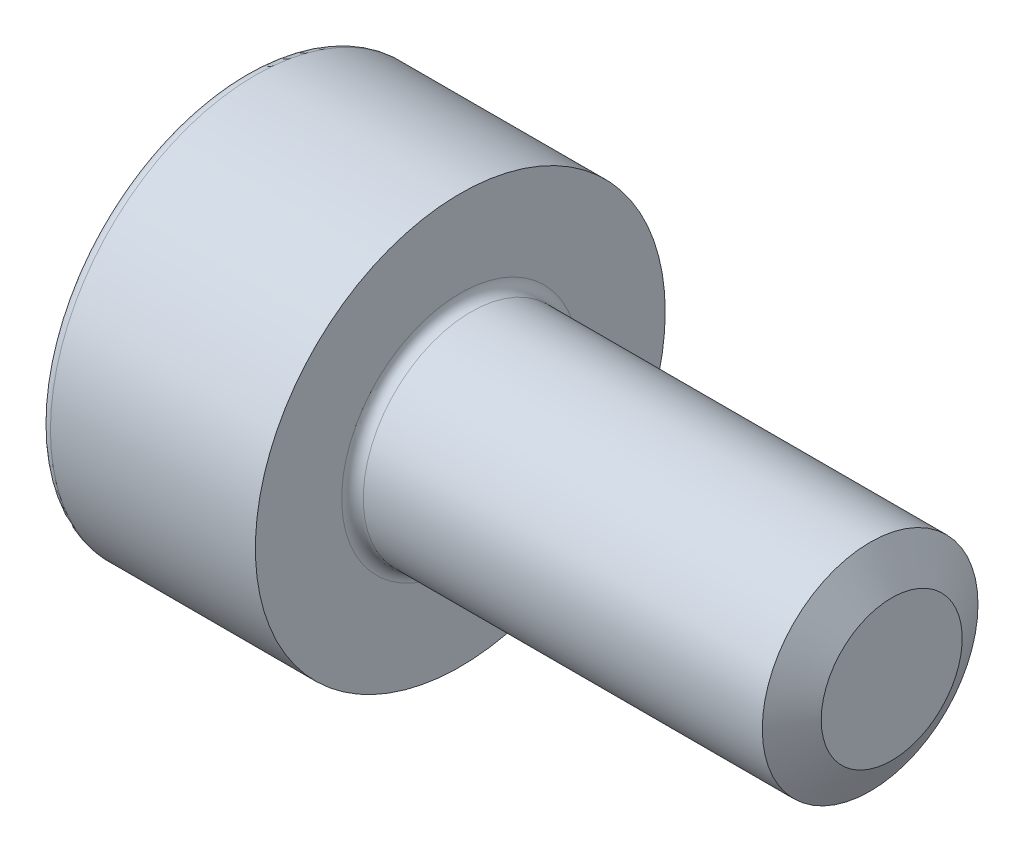
ISO-10303-21;
HEADER;
FILE_DESCRIPTION(('STEP AP214'),'2;1');
FILE_NAME('part.step','',(''),(''),'','','');
FILE_SCHEMA(('AUTOMOTIVE_DESIGN { 1 0 10303 214 1 1 1 1 }'));
ENDSEC;
DATA;
#1=APPLICATION_CONTEXT('core data for automotive mechanical design processes');
#2=APPLICATION_PROTOCOL_DEFINITION('international standard','automotive_design',2000,#1);
#3=PRODUCT_CONTEXT('',#1,'mechanical');
#4=PRODUCT('Part','Part','',(#3));
#5=PRODUCT_RELATED_PRODUCT_CATEGORY('part','',(#4));
#6=PRODUCT_DEFINITION_FORMATION('','',#4);
#7=PRODUCT_DEFINITION_CONTEXT('part definition',#1,'design');
#8=PRODUCT_DEFINITION('design','',#6,#7);
#9=PRODUCT_DEFINITION_SHAPE('','',#8);
#10=(LENGTH_UNIT() NAMED_UNIT(*) SI_UNIT(.MILLI.,.METRE.));
#11=(NAMED_UNIT(*) PLANE_ANGLE_UNIT() SI_UNIT($,.RADIAN.));
#12=(NAMED_UNIT(*) SI_UNIT($,.STERADIAN.) SOLID_ANGLE_UNIT());
#13=UNCERTAINTY_MEASURE_WITH_UNIT(LENGTH_MEASURE(1.E-05),#10,'distance_accuracy_value','');
#14=(GEOMETRIC_REPRESENTATION_CONTEXT(3) GLOBAL_UNCERTAINTY_ASSIGNED_CONTEXT((#13)) GLOBAL_UNIT_ASSIGNED_CONTEXT((#10,
#11,#12)) REPRESENTATION_CONTEXT('',''));
#15=CARTESIAN_POINT('',(0.,0.,0.));
#16=DIRECTION('',(0.,0.,1.));
#17=DIRECTION('',(1.,0.,0.));
#18=AXIS2_PLACEMENT_3D('',#15,#16,#17);
#19=CARTESIAN_POINT('',(0.,0.,0.));
#20=DIRECTION('',(1.,0.,0.));
#21=DIRECTION('',(0.,0.,-1.));
#22=AXIS2_PLACEMENT_3D('',#19,#20,#21);
#23=CYLINDRICAL_SURFACE('',#22,1.);
#24=CARTESIAN_POINT('',(2.1,0.,0.));
#25=DIRECTION('',(1.,0.,0.));
#26=DIRECTION('',(0.,0.,-1.));
#27=AXIS2_PLACEMENT_3D('',#24,#25,#26);
#28=CIRCLE('',#27,1.);
#29=CARTESIAN_POINT('',(2.1,0.,-1.));
#30=VERTEX_POINT('',#29);
#31=EDGE_CURVE('E144',#30,#30,#28,.T.);
#32=ORIENTED_EDGE('',*,*,#31,.T.);
#33=EDGE_LOOP('',(#32));
#34=FACE_BOUND('',#33,.T.);
#35=CARTESIAN_POINT('',(5.8,0.,0.));
#36=DIRECTION('',(-1.,0.,0.));
#37=DIRECTION('',(0.,0.,1.));
#38=AXIS2_PLACEMENT_3D('',#35,#36,#37);
#39=CIRCLE('',#38,1.);
#40=CARTESIAN_POINT('',(5.8,0.,1.));
#41=VERTEX_POINT('',#40);
#42=EDGE_CURVE('E314',#41,#41,#39,.T.);
#43=ORIENTED_EDGE('',*,*,#42,.T.);
#44=EDGE_LOOP('',(#43));
#45=FACE_BOUND('',#44,.T.);
#46=ADVANCED_FACE('F41',(#34,#45),#23,.T.);
#47=CARTESIAN_POINT('',(0.,0.,0.));
#48=DIRECTION('',(-1.,0.,0.));
#49=DIRECTION('',(0.,0.,1.));
#50=AXIS2_PLACEMENT_3D('',#47,#48,#49);
#51=PLANE('',#50);
#52=CARTESIAN_POINT('',(0.,0.,0.));
#53=DIRECTION('',(-1.,0.,0.));
#54=DIRECTION('',(0.,0.,1.));
#55=AXIS2_PLACEMENT_3D('',#52,#53,#54);
#56=CIRCLE('',#55,1.8);
#57=CARTESIAN_POINT('',(0.,0.,1.8));
#58=VERTEX_POINT('',#57);
#59=EDGE_CURVE('E11',#58,#58,#56,.T.);
#60=ORIENTED_EDGE('',*,*,#59,.T.);
#61=EDGE_LOOP('',(#60));
#62=FACE_BOUND('',#61,.T.);
#63=DIRECTION('',(0.,0.5,0.866025403784439));
#64=VECTOR('',#63,1.);
#65=CARTESIAN_POINT('',(0.,-0.865,0.));
#66=LINE('',#65,#64);
#67=CARTESIAN_POINT('',(0.,-0.865,0.));
#68=VERTEX_POINT('',#67);
#69=CARTESIAN_POINT('',(0.,-0.432500000000001,0.749111974273539));
#70=VERTEX_POINT('',#69);
#71=EDGE_CURVE('E56',#68,#70,#66,.T.);
#72=ORIENTED_EDGE('',*,*,#71,.F.);
#73=DIRECTION('',(0.,-0.5,0.866025403784439));
#74=VECTOR('',#73,1.);
#75=CARTESIAN_POINT('',(0.,-0.432500000000001,-0.74911197427354));
#76=LINE('',#75,#74);
#77=CARTESIAN_POINT('',(0.,-0.432500000000001,-0.74911197427354));
#78=VERTEX_POINT('',#77);
#79=EDGE_CURVE('E140',#78,#68,#76,.T.);
#80=ORIENTED_EDGE('',*,*,#79,.F.);
#81=DIRECTION('',(0.,-1.,0.));
#82=VECTOR('',#81,1.);
#83=CARTESIAN_POINT('',(0.,0.4325,-0.74911197427354));
#84=LINE('',#83,#82);
#85=CARTESIAN_POINT('',(0.,0.4325,-0.74911197427354));
#86=VERTEX_POINT('',#85);
#87=EDGE_CURVE('E138',#86,#78,#84,.T.);
#88=ORIENTED_EDGE('',*,*,#87,.F.);
#89=DIRECTION('',(0.,-0.499999999999999,-0.866025403784439));
#90=VECTOR('',#89,1.);
#91=CARTESIAN_POINT('',(0.,0.864999999999999,0.));
#92=LINE('',#91,#90);
#93=CARTESIAN_POINT('',(0.,0.864999999999999,0.));
#94=VERTEX_POINT('',#93);
#95=EDGE_CURVE('E104',#94,#86,#92,.T.);
#96=ORIENTED_EDGE('',*,*,#95,.F.);
#97=DIRECTION('',(0.,0.5,-0.866025403784439));
#98=VECTOR('',#97,1.);
#99=CARTESIAN_POINT('',(0.,0.432499999999999,0.749111974273539));
#100=LINE('',#99,#98);
#101=CARTESIAN_POINT('',(0.,0.432499999999999,0.749111974273539));
#102=VERTEX_POINT('',#101);
#103=EDGE_CURVE('E134',#102,#94,#100,.T.);
#104=ORIENTED_EDGE('',*,*,#103,.F.);
#105=DIRECTION('',(0.,1.,0.));
#106=VECTOR('',#105,1.);
#107=CARTESIAN_POINT('',(0.,-0.432500000000001,0.749111974273539));
#108=LINE('',#107,#106);
#109=EDGE_CURVE('E130',#70,#102,#108,.T.);
#110=ORIENTED_EDGE('',*,*,#109,.F.);
#111=EDGE_LOOP('',(#72,#80,#88,#96,#104,#110));
#112=FACE_BOUND('',#111,.T.);
#113=ADVANCED_FACE('F178',(#62,#112),#51,.T.);
#114=CARTESIAN_POINT('',(0.,0.,0.));
#115=DIRECTION('',(1.,0.,0.));
#116=DIRECTION('',(0.,0.,-1.));
#117=AXIS2_PLACEMENT_3D('',#114,#115,#116);
#118=CYLINDRICAL_SURFACE('',#117,1.9);
#119=CARTESIAN_POINT('',(0.1,0.,0.));
#120=DIRECTION('',(-1.,0.,0.));
#121=DIRECTION('',(0.,0.,1.));
#122=AXIS2_PLACEMENT_3D('',#119,#120,#121);
#123=CIRCLE('',#122,1.9);
#124=CARTESIAN_POINT('',(0.1,0.,1.9));
#125=VERTEX_POINT('',#124);
#126=EDGE_CURVE('E49',#125,#125,#123,.F.);
#127=ORIENTED_EDGE('',*,*,#126,.T.);
#128=EDGE_LOOP('',(#127));
#129=FACE_BOUND('',#128,.T.);
#130=CARTESIAN_POINT('',(2.,0.,0.));
#131=DIRECTION('',(1.,0.,0.));
#132=DIRECTION('',(0.,0.,-1.));
#133=AXIS2_PLACEMENT_3D('',#130,#131,#132);
#134=CIRCLE('',#133,1.9);
#135=CARTESIAN_POINT('',(2.,0.,-1.9));
#136=VERTEX_POINT('',#135);
#137=EDGE_CURVE('E155',#136,#136,#134,.T.);
#138=ORIENTED_EDGE('',*,*,#137,.F.);
#139=EDGE_LOOP('',(#138));
#140=FACE_BOUND('',#139,.T.);
#141=ADVANCED_FACE('F161',(#129,#140),#118,.T.);
#142=CARTESIAN_POINT('',(2.,1.9,0.));
#143=DIRECTION('',(1.,0.,0.));
#144=DIRECTION('',(0.,0.,-1.));
#145=AXIS2_PLACEMENT_3D('',#142,#143,#144);
#146=PLANE('',#145);
#147=ORIENTED_EDGE('',*,*,#137,.T.);
#148=EDGE_LOOP('',(#147));
#149=FACE_BOUND('',#148,.T.);
#150=CARTESIAN_POINT('',(2.,0.,0.));
#151=DIRECTION('',(1.,0.,0.));
#152=DIRECTION('',(0.,0.,-1.));
#153=AXIS2_PLACEMENT_3D('',#150,#151,#152);
#154=CIRCLE('',#153,1.1);
#155=CARTESIAN_POINT('',(2.,0.,-1.1));
#156=VERTEX_POINT('',#155);
#157=EDGE_CURVE('E152',#156,#156,#154,.T.);
#158=ORIENTED_EDGE('',*,*,#157,.F.);
#159=EDGE_LOOP('',(#158));
#160=FACE_BOUND('',#159,.T.);
#161=ADVANCED_FACE('F193',(#149,#160),#146,.T.);
#162=CARTESIAN_POINT('',(2.1,0.,0.));
#163=DIRECTION('',(1.,0.,0.));
#164=DIRECTION('',(0.,0.,-1.));
#165=AXIS2_PLACEMENT_3D('',#162,#163,#164);
#166=TOROIDAL_SURFACE('',#165,1.1,0.1);
#167=ORIENTED_EDGE('',*,*,#157,.T.);
#168=EDGE_LOOP('',(#167));
#169=FACE_BOUND('',#168,.T.);
#170=ORIENTED_EDGE('',*,*,#31,.F.);
#171=EDGE_LOOP('',(#170));
#172=FACE_BOUND('',#171,.T.);
#173=ADVANCED_FACE('F189',(#169,#172),#166,.F.);
#174=CARTESIAN_POINT('',(1.,-0.865,0.));
#175=DIRECTION('',(0.,-0.866025403784439,0.5));
#176=DIRECTION('',(0.,-0.5,-0.866025403784439));
#177=AXIS2_PLACEMENT_3D('',#174,#175,#176);
#178=PLANE('',#177);
#179=ORIENTED_EDGE('',*,*,#71,.T.);
#180=DIRECTION('',(-1.,0.,0.));
#181=VECTOR('',#180,1.);
#182=CARTESIAN_POINT('',(1.,-0.432500000000001,0.749111974273539));
#183=LINE('',#182,#181);
#184=CARTESIAN_POINT('',(1.,-0.432500000000001,0.749111974273539));
#185=VERTEX_POINT('',#184);
#186=EDGE_CURVE('E86',#185,#70,#183,.T.);
#187=ORIENTED_EDGE('',*,*,#186,.F.);
#188=DIRECTION('',(0.,0.5,0.866025403784439));
#189=VECTOR('',#188,1.);
#190=CARTESIAN_POINT('',(1.,-0.865,0.));
#191=LINE('',#190,#189);
#192=CARTESIAN_POINT('',(1.,-0.865,0.));
#193=VERTEX_POINT('',#192);
#194=EDGE_CURVE('E142',#193,#185,#191,.T.);
#195=ORIENTED_EDGE('',*,*,#194,.F.);
#196=DIRECTION('',(-1.,0.,0.));
#197=VECTOR('',#196,1.);
#198=CARTESIAN_POINT('',(1.,-0.865,0.));
#199=LINE('',#198,#197);
#200=EDGE_CURVE('E64',#193,#68,#199,.T.);
#201=ORIENTED_EDGE('',*,*,#200,.T.);
#202=EDGE_LOOP('',(#179,#187,#195,#201));
#203=FACE_BOUND('',#202,.T.);
#204=ADVANCED_FACE('F192',(#203),#178,.F.);
#205=CARTESIAN_POINT('',(1.,-0.432500000000001,-0.74911197427354));
#206=DIRECTION('',(0.,-0.866025403784439,-0.5));
#207=DIRECTION('',(0.,0.5,-0.866025403784439));
#208=AXIS2_PLACEMENT_3D('',#205,#206,#207);
#209=PLANE('',#208);
#210=ORIENTED_EDGE('',*,*,#79,.T.);
#211=ORIENTED_EDGE('',*,*,#200,.F.);
#212=DIRECTION('',(0.,-0.5,0.866025403784439));
#213=VECTOR('',#212,1.);
#214=CARTESIAN_POINT('',(1.,-0.432500000000001,-0.74911197427354));
#215=LINE('',#214,#213);
#216=CARTESIAN_POINT('',(1.,-0.432500000000001,-0.74911197427354));
#217=VERTEX_POINT('',#216);
#218=EDGE_CURVE('E116',#217,#193,#215,.T.);
#219=ORIENTED_EDGE('',*,*,#218,.F.);
#220=DIRECTION('',(-1.,0.,0.));
#221=VECTOR('',#220,1.);
#222=CARTESIAN_POINT('',(1.,-0.432500000000001,-0.74911197427354));
#223=LINE('',#222,#221);
#224=EDGE_CURVE('E108',#217,#78,#223,.T.);
#225=ORIENTED_EDGE('',*,*,#224,.T.);
#226=EDGE_LOOP('',(#210,#211,#219,#225));
#227=FACE_BOUND('',#226,.T.);
#228=ADVANCED_FACE('F217',(#227),#209,.F.);
#229=CARTESIAN_POINT('',(1.,0.4325,-0.74911197427354));
#230=DIRECTION('',(0.,0.,-1.));
#231=DIRECTION('',(-1.,0.,0.));
#232=AXIS2_PLACEMENT_3D('',#229,#230,#231);
#233=PLANE('',#232);
#234=ORIENTED_EDGE('',*,*,#87,.T.);
#235=ORIENTED_EDGE('',*,*,#224,.F.);
#236=DIRECTION('',(0.,-1.,0.));
#237=VECTOR('',#236,1.);
#238=CARTESIAN_POINT('',(1.,0.4325,-0.74911197427354));
#239=LINE('',#238,#237);
#240=CARTESIAN_POINT('',(1.,0.4325,-0.74911197427354));
#241=VERTEX_POINT('',#240);
#242=EDGE_CURVE('E112',#241,#217,#239,.T.);
#243=ORIENTED_EDGE('',*,*,#242,.F.);
#244=DIRECTION('',(-1.,0.,0.));
#245=VECTOR('',#244,1.);
#246=CARTESIAN_POINT('',(1.,0.4325,-0.74911197427354));
#247=LINE('',#246,#245);
#248=EDGE_CURVE('E97',#241,#86,#247,.T.);
#249=ORIENTED_EDGE('',*,*,#248,.T.);
#250=EDGE_LOOP('',(#234,#235,#243,#249));
#251=FACE_BOUND('',#250,.T.);
#252=ADVANCED_FACE('F113',(#251),#233,.F.);
#253=CARTESIAN_POINT('',(1.,0.864999999999999,0.));
#254=DIRECTION('',(0.,0.866025403784439,-0.499999999999999));
#255=DIRECTION('',(0.,0.499999999999999,0.866025403784439));
#256=AXIS2_PLACEMENT_3D('',#253,#254,#255);
#257=PLANE('',#256);
#258=ORIENTED_EDGE('',*,*,#95,.T.);
#259=ORIENTED_EDGE('',*,*,#248,.F.);
#260=DIRECTION('',(0.,-0.499999999999999,-0.866025403784439));
#261=VECTOR('',#260,1.);
#262=CARTESIAN_POINT('',(1.,0.864999999999999,0.));
#263=LINE('',#262,#261);
#264=CARTESIAN_POINT('',(1.,0.864999999999999,0.));
#265=VERTEX_POINT('',#264);
#266=EDGE_CURVE('E101',#265,#241,#263,.T.);
#267=ORIENTED_EDGE('',*,*,#266,.F.);
#268=DIRECTION('',(-1.,0.,0.));
#269=VECTOR('',#268,1.);
#270=CARTESIAN_POINT('',(1.,0.864999999999999,0.));
#271=LINE('',#270,#269);
#272=EDGE_CURVE('E109',#265,#94,#271,.T.);
#273=ORIENTED_EDGE('',*,*,#272,.T.);
#274=EDGE_LOOP('',(#258,#259,#267,#273));
#275=FACE_BOUND('',#274,.T.);
#276=ADVANCED_FACE('F99',(#275),#257,.F.);
#277=CARTESIAN_POINT('',(1.,0.432499999999999,0.749111974273539));
#278=DIRECTION('',(0.,0.866025403784439,0.5));
#279=DIRECTION('',(0.,-0.5,0.866025403784439));
#280=AXIS2_PLACEMENT_3D('',#277,#278,#279);
#281=PLANE('',#280);
#282=ORIENTED_EDGE('',*,*,#103,.T.);
#283=ORIENTED_EDGE('',*,*,#272,.F.);
#284=DIRECTION('',(0.,0.5,-0.866025403784439));
#285=VECTOR('',#284,1.);
#286=CARTESIAN_POINT('',(1.,0.432499999999999,0.749111974273539));
#287=LINE('',#286,#285);
#288=CARTESIAN_POINT('',(1.,0.432499999999999,0.749111974273539));
#289=VERTEX_POINT('',#288);
#290=EDGE_CURVE('E122',#289,#265,#287,.T.);
#291=ORIENTED_EDGE('',*,*,#290,.F.);
#292=DIRECTION('',(-1.,0.,0.));
#293=VECTOR('',#292,1.);
#294=CARTESIAN_POINT('',(1.,0.432499999999999,0.749111974273539));
#295=LINE('',#294,#293);
#296=EDGE_CURVE('E147',#289,#102,#295,.T.);
#297=ORIENTED_EDGE('',*,*,#296,.T.);
#298=EDGE_LOOP('',(#282,#283,#291,#297));
#299=FACE_BOUND('',#298,.T.);
#300=ADVANCED_FACE('F235',(#299),#281,.F.);
#301=CARTESIAN_POINT('',(1.,-0.432500000000001,0.749111974273539));
#302=DIRECTION('',(0.,0.,1.));
#303=DIRECTION('',(1.,0.,0.));
#304=AXIS2_PLACEMENT_3D('',#301,#302,#303);
#305=PLANE('',#304);
#306=ORIENTED_EDGE('',*,*,#109,.T.);
#307=ORIENTED_EDGE('',*,*,#296,.F.);
#308=DIRECTION('',(0.,1.,0.));
#309=VECTOR('',#308,1.);
#310=CARTESIAN_POINT('',(1.,-0.432500000000001,0.749111974273539));
#311=LINE('',#310,#309);
#312=EDGE_CURVE('E124',#185,#289,#311,.T.);
#313=ORIENTED_EDGE('',*,*,#312,.F.);
#314=ORIENTED_EDGE('',*,*,#186,.T.);
#315=EDGE_LOOP('',(#306,#307,#313,#314));
#316=FACE_BOUND('',#315,.T.);
#317=ADVANCED_FACE('F174',(#316),#305,.F.);
#318=CARTESIAN_POINT('',(1.,-0.4325,0.749111974273539));
#319=DIRECTION('',(-1.,0.,0.));
#320=DIRECTION('',(0.,0.,1.));
#321=AXIS2_PLACEMENT_3D('',#318,#319,#320);
#322=PLANE('',#321);
#323=ORIENTED_EDGE('',*,*,#194,.T.);
#324=ORIENTED_EDGE('',*,*,#312,.T.);
#325=ORIENTED_EDGE('',*,*,#290,.T.);
#326=ORIENTED_EDGE('',*,*,#266,.T.);
#327=ORIENTED_EDGE('',*,*,#242,.T.);
#328=ORIENTED_EDGE('',*,*,#218,.T.);
#329=EDGE_LOOP('',(#323,#324,#325,#326,#327,#328));
#330=FACE_BOUND('',#329,.T.);
#331=ADVANCED_FACE('F119',(#330),#322,.T.);
#332=CARTESIAN_POINT('',(0.1,0.,0.));
#333=DIRECTION('',(-1.,0.,0.));
#334=DIRECTION('',(0.,0.,1.));
#335=AXIS2_PLACEMENT_3D('',#332,#333,#334);
#336=TOROIDAL_SURFACE('',#335,1.8,0.1);
#337=ORIENTED_EDGE('',*,*,#59,.F.);
#338=EDGE_LOOP('',(#337));
#339=FACE_BOUND('',#338,.T.);
#340=ORIENTED_EDGE('',*,*,#126,.F.);
#341=EDGE_LOOP('',(#340));
#342=FACE_BOUND('',#341,.T.);
#343=ADVANCED_FACE('F43',(#339,#342),#336,.T.);
#344=CARTESIAN_POINT('',(5.8,0.,0.));
#345=DIRECTION('',(-1.,0.,0.));
#346=DIRECTION('',(0.,0.,1.));
#347=AXIS2_PLACEMENT_3D('',#344,#345,#346);
#348=CONICAL_SURFACE('',#347,1.,1.04718484902493);
#349=CARTESIAN_POINT('',(6.,0.,0.));
#350=DIRECTION('',(-1.,0.,0.));
#351=DIRECTION('',(0.,0.,1.));
#352=AXIS2_PLACEMENT_3D('',#349,#350,#351);
#353=CIRCLE('',#352,0.6536);
#354=CARTESIAN_POINT('',(6.,0.,0.6536));
#355=VERTEX_POINT('',#354);
#356=EDGE_CURVE('E131',#355,#355,#353,.T.);
#357=ORIENTED_EDGE('',*,*,#356,.T.);
#358=EDGE_LOOP('',(#357));
#359=FACE_BOUND('',#358,.T.);
#360=ORIENTED_EDGE('',*,*,#42,.F.);
#361=EDGE_LOOP('',(#360));
#362=FACE_BOUND('',#361,.T.);
#363=ADVANCED_FACE('F165',(#359,#362),#348,.T.);
#364=CARTESIAN_POINT('',(6.,1.,0.));
#365=DIRECTION('',(1.,0.,0.));
#366=DIRECTION('',(0.,0.,-1.));
#367=AXIS2_PLACEMENT_3D('',#364,#365,#366);
#368=PLANE('',#367);
#369=ORIENTED_EDGE('',*,*,#356,.F.);
#370=EDGE_LOOP('',(#369));
#371=FACE_BOUND('',#370,.T.);
#372=ADVANCED_FACE('F171',(#371),#368,.T.);
#373=CLOSED_SHELL('',(#46,#113,#141,#161,#173,#204,#228,#252,#276,#300,#317,#331,#343,#363,#372));
#374=MANIFOLD_SOLID_BREP('B2',#373);
#375=ADVANCED_BREP_SHAPE_REPRESENTATION('',(#18,#374),#14);
#376=SHAPE_DEFINITION_REPRESENTATION(#9,#375);
ENDSEC;
END-ISO-10303-21;
